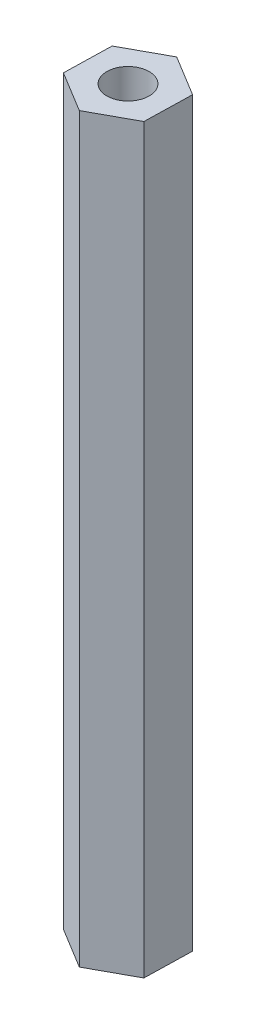
ISO-10303-21;
HEADER;
FILE_DESCRIPTION(('STEP AP214'),'2;1');
FILE_NAME('part.step','',(''),(''),'','','');
FILE_SCHEMA(('AUTOMOTIVE_DESIGN { 1 0 10303 214 1 1 1 1 }'));
ENDSEC;
DATA;
#1=APPLICATION_CONTEXT('core data for automotive mechanical design processes');
#2=APPLICATION_PROTOCOL_DEFINITION('international standard','automotive_design',2000,#1);
#3=PRODUCT_CONTEXT('',#1,'mechanical');
#4=PRODUCT('Part','Part','',(#3));
#5=PRODUCT_RELATED_PRODUCT_CATEGORY('part','',(#4));
#6=PRODUCT_DEFINITION_FORMATION('','',#4);
#7=PRODUCT_DEFINITION_CONTEXT('part definition',#1,'design');
#8=PRODUCT_DEFINITION('design','',#6,#7);
#9=PRODUCT_DEFINITION_SHAPE('','',#8);
#10=(LENGTH_UNIT() NAMED_UNIT(*) SI_UNIT(.MILLI.,.METRE.));
#11=(NAMED_UNIT(*) PLANE_ANGLE_UNIT() SI_UNIT($,.RADIAN.));
#12=(NAMED_UNIT(*) SI_UNIT($,.STERADIAN.) SOLID_ANGLE_UNIT());
#13=UNCERTAINTY_MEASURE_WITH_UNIT(LENGTH_MEASURE(1.E-05),#10,'distance_accuracy_value','');
#14=(GEOMETRIC_REPRESENTATION_CONTEXT(3) GLOBAL_UNCERTAINTY_ASSIGNED_CONTEXT((#13)) GLOBAL_UNIT_ASSIGNED_CONTEXT((#10,
#11,#12)) REPRESENTATION_CONTEXT('',''));
#15=CARTESIAN_POINT('',(0.,0.,0.));
#16=DIRECTION('',(0.,0.,1.));
#17=DIRECTION('',(1.,0.,0.));
#18=AXIS2_PLACEMENT_3D('',#15,#16,#17);
#19=CARTESIAN_POINT('',(6.26209311880989,57.15,3.81438371230362));
#20=DIRECTION('',(-0.999723848256013,0.,-0.0234995154883728));
#21=DIRECTION('',(-0.0234995154883728,0.,0.999723848256013));
#22=AXIS2_PLACEMENT_3D('',#19,#20,#21);
#23=PLANE('',#22);
#24=DIRECTION('',(0.0234995154883728,0.,-0.999723848256013));
#25=VECTOR('',#24,1.);
#26=CARTESIAN_POINT('',(6.26209311880989,-57.15,3.81438371230362));
#27=LINE('',#26,#25);
#28=CARTESIAN_POINT('',(6.26209311880989,-57.15,3.81438371230362));
#29=VERTEX_POINT('',#28);
#30=CARTESIAN_POINT('',(6.43439975404147,-57.15,-3.51593986560128));
#31=VERTEX_POINT('',#30);
#32=EDGE_CURVE('E116',#29,#31,#27,.T.);
#33=ORIENTED_EDGE('',*,*,#32,.T.);
#34=DIRECTION('',(0.,-1.,0.));
#35=VECTOR('',#34,1.);
#36=CARTESIAN_POINT('',(6.43439975404147,57.15,-3.51593986560128));
#37=LINE('',#36,#35);
#38=CARTESIAN_POINT('',(6.43439975404147,57.15,-3.51593986560128));
#39=VERTEX_POINT('',#38);
#40=EDGE_CURVE('E11',#39,#31,#37,.T.);
#41=ORIENTED_EDGE('',*,*,#40,.F.);
#42=DIRECTION('',(0.0234995154883728,0.,-0.999723848256013));
#43=VECTOR('',#42,1.);
#44=CARTESIAN_POINT('',(6.26209311880989,57.15,3.81438371230362));
#45=LINE('',#44,#43);
#46=CARTESIAN_POINT('',(6.26209311880989,57.15,3.81438371230362));
#47=VERTEX_POINT('',#46);
#48=EDGE_CURVE('E127',#47,#39,#45,.T.);
#49=ORIENTED_EDGE('',*,*,#48,.F.);
#50=DIRECTION('',(0.,-1.,0.));
#51=VECTOR('',#50,1.);
#52=CARTESIAN_POINT('',(6.26209311880989,57.15,3.81438371230362));
#53=LINE('',#52,#51);
#54=EDGE_CURVE('E112',#47,#29,#53,.T.);
#55=ORIENTED_EDGE('',*,*,#54,.T.);
#56=EDGE_LOOP('',(#33,#41,#49,#55));
#57=FACE_BOUND('',#56,.T.);
#58=ADVANCED_FACE('F32',(#57),#23,.F.);
#59=CARTESIAN_POINT('',(6.43439975404147,57.15,-3.51593986560128));
#60=DIRECTION('',(-0.520213101517563,0.,0.85403649161466));
#61=DIRECTION('',(0.85403649161466,0.,0.520213101517563));
#62=AXIS2_PLACEMENT_3D('',#59,#60,#61);
#63=PLANE('',#62);
#64=DIRECTION('',(-0.85403649161466,0.,-0.520213101517563));
#65=VECTOR('',#64,1.);
#66=CARTESIAN_POINT('',(6.43439975404147,-57.15,-3.51593986560128));
#67=LINE('',#66,#65);
#68=CARTESIAN_POINT('',(0.172306635231581,-57.15,-7.3303235779049));
#69=VERTEX_POINT('',#68);
#70=EDGE_CURVE('E119',#31,#69,#67,.T.);
#71=ORIENTED_EDGE('',*,*,#70,.T.);
#72=DIRECTION('',(0.,-1.,0.));
#73=VECTOR('',#72,1.);
#74=CARTESIAN_POINT('',(0.172306635231581,57.15,-7.3303235779049));
#75=LINE('',#74,#73);
#76=CARTESIAN_POINT('',(0.172306635231581,57.15,-7.3303235779049));
#77=VERTEX_POINT('',#76);
#78=EDGE_CURVE('E40',#77,#69,#75,.T.);
#79=ORIENTED_EDGE('',*,*,#78,.F.);
#80=DIRECTION('',(-0.85403649161466,0.,-0.520213101517563));
#81=VECTOR('',#80,1.);
#82=CARTESIAN_POINT('',(6.43439975404147,57.15,-3.51593986560128));
#83=LINE('',#82,#81);
#84=EDGE_CURVE('E85',#39,#77,#83,.T.);
#85=ORIENTED_EDGE('',*,*,#84,.F.);
#86=ORIENTED_EDGE('',*,*,#40,.T.);
#87=EDGE_LOOP('',(#71,#79,#85,#86));
#88=FACE_BOUND('',#87,.T.);
#89=ADVANCED_FACE('F152',(#88),#63,.F.);
#90=CARTESIAN_POINT('',(0.172306635231581,57.15,-7.3303235779049));
#91=DIRECTION('',(0.479510746738449,0.,0.877536007103033));
#92=DIRECTION('',(0.877536007103033,0.,-0.479510746738449));
#93=AXIS2_PLACEMENT_3D('',#90,#91,#92);
#94=PLANE('',#93);
#95=DIRECTION('',(-0.877536007103033,0.,0.479510746738449));
#96=VECTOR('',#95,1.);
#97=CARTESIAN_POINT('',(0.172306635231581,-57.15,-7.3303235779049));
#98=LINE('',#97,#96);
#99=CARTESIAN_POINT('',(-6.26209311880989,-57.15,-3.81438371230362));
#100=VERTEX_POINT('',#99);
#101=EDGE_CURVE('E122',#69,#100,#98,.T.);
#102=ORIENTED_EDGE('',*,*,#101,.T.);
#103=DIRECTION('',(0.,-1.,0.));
#104=VECTOR('',#103,1.);
#105=CARTESIAN_POINT('',(-6.26209311880989,57.15,-3.81438371230362));
#106=LINE('',#105,#104);
#107=CARTESIAN_POINT('',(-6.26209311880989,57.15,-3.81438371230362));
#108=VERTEX_POINT('',#107);
#109=EDGE_CURVE('E107',#108,#100,#106,.T.);
#110=ORIENTED_EDGE('',*,*,#109,.F.);
#111=DIRECTION('',(-0.877536007103033,0.,0.479510746738449));
#112=VECTOR('',#111,1.);
#113=CARTESIAN_POINT('',(0.172306635231581,57.15,-7.3303235779049));
#114=LINE('',#113,#112);
#115=EDGE_CURVE('E98',#77,#108,#114,.T.);
#116=ORIENTED_EDGE('',*,*,#115,.F.);
#117=ORIENTED_EDGE('',*,*,#78,.T.);
#118=EDGE_LOOP('',(#102,#110,#116,#117));
#119=FACE_BOUND('',#118,.T.);
#120=ADVANCED_FACE('F133',(#119),#94,.F.);
#121=CARTESIAN_POINT('',(-6.26209311880989,57.15,-3.81438371230362));
#122=DIRECTION('',(0.999723848256013,0.,0.0234995154883731));
#123=DIRECTION('',(0.0234995154883731,0.,-0.999723848256013));
#124=AXIS2_PLACEMENT_3D('',#121,#122,#123);
#125=PLANE('',#124);
#126=DIRECTION('',(-0.0234995154883731,0.,0.999723848256013));
#127=VECTOR('',#126,1.);
#128=CARTESIAN_POINT('',(-6.26209311880989,-57.15,-3.81438371230362));
#129=LINE('',#128,#127);
#130=CARTESIAN_POINT('',(-6.43439975404147,-57.15,3.51593986560128));
#131=VERTEX_POINT('',#130);
#132=EDGE_CURVE('E106',#100,#131,#129,.T.);
#133=ORIENTED_EDGE('',*,*,#132,.T.);
#134=DIRECTION('',(0.,-1.,0.));
#135=VECTOR('',#134,1.);
#136=CARTESIAN_POINT('',(-6.43439975404147,57.15,3.51593986560128));
#137=LINE('',#136,#135);
#138=CARTESIAN_POINT('',(-6.43439975404147,57.15,3.51593986560128));
#139=VERTEX_POINT('',#138);
#140=EDGE_CURVE('E103',#139,#131,#137,.T.);
#141=ORIENTED_EDGE('',*,*,#140,.F.);
#142=DIRECTION('',(-0.0234995154883731,0.,0.999723848256013));
#143=VECTOR('',#142,1.);
#144=CARTESIAN_POINT('',(-6.26209311880989,57.15,-3.81438371230362));
#145=LINE('',#144,#143);
#146=EDGE_CURVE('E92',#108,#139,#145,.T.);
#147=ORIENTED_EDGE('',*,*,#146,.F.);
#148=ORIENTED_EDGE('',*,*,#109,.T.);
#149=EDGE_LOOP('',(#133,#141,#147,#148));
#150=FACE_BOUND('',#149,.T.);
#151=ADVANCED_FACE('F104',(#150),#125,.F.);
#152=CARTESIAN_POINT('',(-6.43439975404147,57.15,3.51593986560128));
#153=DIRECTION('',(0.520213101517564,0.,-0.85403649161466));
#154=DIRECTION('',(-0.85403649161466,0.,-0.520213101517564));
#155=AXIS2_PLACEMENT_3D('',#152,#153,#154);
#156=PLANE('',#155);
#157=DIRECTION('',(0.85403649161466,0.,0.520213101517564));
#158=VECTOR('',#157,1.);
#159=CARTESIAN_POINT('',(-6.43439975404147,-57.15,3.51593986560128));
#160=LINE('',#159,#158);
#161=CARTESIAN_POINT('',(-0.172306635231583,-57.15,7.3303235779049));
#162=VERTEX_POINT('',#161);
#163=EDGE_CURVE('E71',#131,#162,#160,.T.);
#164=ORIENTED_EDGE('',*,*,#163,.T.);
#165=DIRECTION('',(0.,-1.,0.));
#166=VECTOR('',#165,1.);
#167=CARTESIAN_POINT('',(-0.172306635231583,57.15,7.3303235779049));
#168=LINE('',#167,#166);
#169=CARTESIAN_POINT('',(-0.172306635231583,57.15,7.3303235779049));
#170=VERTEX_POINT('',#169);
#171=EDGE_CURVE('E108',#170,#162,#168,.T.);
#172=ORIENTED_EDGE('',*,*,#171,.F.);
#173=DIRECTION('',(0.85403649161466,0.,0.520213101517564));
#174=VECTOR('',#173,1.);
#175=CARTESIAN_POINT('',(-6.43439975404147,57.15,3.51593986560128));
#176=LINE('',#175,#174);
#177=EDGE_CURVE('E96',#139,#170,#176,.T.);
#178=ORIENTED_EDGE('',*,*,#177,.F.);
#179=ORIENTED_EDGE('',*,*,#140,.T.);
#180=EDGE_LOOP('',(#164,#172,#178,#179));
#181=FACE_BOUND('',#180,.T.);
#182=ADVANCED_FACE('F110',(#181),#156,.F.);
#183=CARTESIAN_POINT('',(-0.172306635231583,57.15,7.3303235779049));
#184=DIRECTION('',(-0.47951074673845,0.,-0.877536007103033));
#185=DIRECTION('',(-0.877536007103033,0.,0.47951074673845));
#186=AXIS2_PLACEMENT_3D('',#183,#184,#185);
#187=PLANE('',#186);
#188=DIRECTION('',(0.877536007103033,0.,-0.47951074673845));
#189=VECTOR('',#188,1.);
#190=CARTESIAN_POINT('',(-0.172306635231583,-57.15,7.3303235779049));
#191=LINE('',#190,#189);
#192=EDGE_CURVE('E77',#162,#29,#191,.T.);
#193=ORIENTED_EDGE('',*,*,#192,.T.);
#194=ORIENTED_EDGE('',*,*,#54,.F.);
#195=DIRECTION('',(0.877536007103033,0.,-0.47951074673845));
#196=VECTOR('',#195,1.);
#197=CARTESIAN_POINT('',(-0.172306635231583,57.15,7.3303235779049));
#198=LINE('',#197,#196);
#199=EDGE_CURVE('E48',#170,#47,#198,.T.);
#200=ORIENTED_EDGE('',*,*,#199,.F.);
#201=ORIENTED_EDGE('',*,*,#171,.T.);
#202=EDGE_LOOP('',(#193,#194,#200,#201));
#203=FACE_BOUND('',#202,.T.);
#204=ADVANCED_FACE('F140',(#203),#187,.F.);
#205=CARTESIAN_POINT('',(0.,57.15,0.));
#206=DIRECTION('',(0.,1.,0.));
#207=DIRECTION('',(0.,0.,1.));
#208=AXIS2_PLACEMENT_3D('',#205,#206,#207);
#209=PLANE('',#208);
#210=CARTESIAN_POINT('',(0.,57.15,0.));
#211=DIRECTION('',(0.,1.,0.));
#212=DIRECTION('',(0.,0.,1.));
#213=AXIS2_PLACEMENT_3D('',#210,#211,#212);
#214=CIRCLE('',#213,3.2639);
#215=CARTESIAN_POINT('',(0.,57.15,3.2639));
#216=VERTEX_POINT('',#215);
#217=EDGE_CURVE('E235',#216,#216,#214,.T.);
#218=ORIENTED_EDGE('',*,*,#217,.F.);
#219=EDGE_LOOP('',(#218));
#220=FACE_BOUND('',#219,.T.);
#221=ORIENTED_EDGE('',*,*,#48,.T.);
#222=ORIENTED_EDGE('',*,*,#84,.T.);
#223=ORIENTED_EDGE('',*,*,#115,.T.);
#224=ORIENTED_EDGE('',*,*,#146,.T.);
#225=ORIENTED_EDGE('',*,*,#177,.T.);
#226=ORIENTED_EDGE('',*,*,#199,.T.);
#227=EDGE_LOOP('',(#221,#222,#223,#224,#225,#226));
#228=FACE_BOUND('',#227,.T.);
#229=ADVANCED_FACE('F94',(#220,#228),#209,.T.);
#230=CARTESIAN_POINT('',(0.,-57.15,0.));
#231=DIRECTION('',(0.,1.,0.));
#232=DIRECTION('',(0.,0.,1.));
#233=AXIS2_PLACEMENT_3D('',#230,#231,#232);
#234=PLANE('',#233);
#235=CARTESIAN_POINT('',(0.,-57.15,0.));
#236=DIRECTION('',(0.,1.,0.));
#237=DIRECTION('',(0.,0.,1.));
#238=AXIS2_PLACEMENT_3D('',#235,#236,#237);
#239=CIRCLE('',#238,3.2639);
#240=CARTESIAN_POINT('',(0.,-57.15,3.2639));
#241=VERTEX_POINT('',#240);
#242=EDGE_CURVE('E236',#241,#241,#239,.T.);
#243=ORIENTED_EDGE('',*,*,#242,.T.);
#244=EDGE_LOOP('',(#243));
#245=FACE_BOUND('',#244,.T.);
#246=ORIENTED_EDGE('',*,*,#32,.F.);
#247=ORIENTED_EDGE('',*,*,#192,.F.);
#248=ORIENTED_EDGE('',*,*,#163,.F.);
#249=ORIENTED_EDGE('',*,*,#132,.F.);
#250=ORIENTED_EDGE('',*,*,#101,.F.);
#251=ORIENTED_EDGE('',*,*,#70,.F.);
#252=EDGE_LOOP('',(#246,#247,#248,#249,#250,#251));
#253=FACE_BOUND('',#252,.T.);
#254=ADVANCED_FACE('F136',(#245,#253),#234,.F.);
#255=CARTESIAN_POINT('',(0.,44.45,0.));
#256=DIRECTION('',(0.,1.,0.));
#257=DIRECTION('',(0.,0.,1.));
#258=AXIS2_PLACEMENT_3D('',#255,#256,#257);
#259=CYLINDRICAL_SURFACE('',#258,3.2639);
#260=CARTESIAN_POINT('',(0.,44.45,0.));
#261=DIRECTION('',(0.,1.,0.));
#262=DIRECTION('',(0.,0.,1.));
#263=AXIS2_PLACEMENT_3D('',#260,#261,#262);
#264=CIRCLE('',#263,3.2639);
#265=CARTESIAN_POINT('',(0.,44.45,3.2639));
#266=VERTEX_POINT('',#265);
#267=EDGE_CURVE('E120',#266,#266,#264,.T.);
#268=ORIENTED_EDGE('',*,*,#267,.F.);
#269=EDGE_LOOP('',(#268));
#270=FACE_BOUND('',#269,.T.);
#271=ORIENTED_EDGE('',*,*,#217,.T.);
#272=EDGE_LOOP('',(#271));
#273=FACE_BOUND('',#272,.T.);
#274=ADVANCED_FACE('F187',(#270,#273),#259,.F.);
#275=CARTESIAN_POINT('',(0.,44.45,0.));
#276=DIRECTION('',(0.,1.,0.));
#277=DIRECTION('',(0.,0.,1.));
#278=AXIS2_PLACEMENT_3D('',#275,#276,#277);
#279=PLANE('',#278);
#280=ORIENTED_EDGE('',*,*,#267,.T.);
#281=EDGE_LOOP('',(#280));
#282=FACE_BOUND('',#281,.T.);
#283=ADVANCED_FACE('F192',(#282),#279,.T.);
#284=CARTESIAN_POINT('',(0.,-44.45,0.));
#285=DIRECTION('',(0.,-1.,0.));
#286=DIRECTION('',(0.,0.,-1.));
#287=AXIS2_PLACEMENT_3D('',#284,#285,#286);
#288=CYLINDRICAL_SURFACE('',#287,3.2639);
#289=CARTESIAN_POINT('',(0.,-44.45,0.));
#290=DIRECTION('',(0.,1.,0.));
#291=DIRECTION('',(0.,0.,1.));
#292=AXIS2_PLACEMENT_3D('',#289,#290,#291);
#293=CIRCLE('',#292,3.2639);
#294=CARTESIAN_POINT('',(0.,-44.45,3.2639));
#295=VERTEX_POINT('',#294);
#296=EDGE_CURVE('E234',#295,#295,#293,.T.);
#297=ORIENTED_EDGE('',*,*,#296,.T.);
#298=EDGE_LOOP('',(#297));
#299=FACE_BOUND('',#298,.T.);
#300=ORIENTED_EDGE('',*,*,#242,.F.);
#301=EDGE_LOOP('',(#300));
#302=FACE_BOUND('',#301,.T.);
#303=ADVANCED_FACE('F202',(#299,#302),#288,.F.);
#304=CARTESIAN_POINT('',(0.,-44.45,0.));
#305=DIRECTION('',(0.,-1.,0.));
#306=DIRECTION('',(0.,0.,1.));
#307=AXIS2_PLACEMENT_3D('',#304,#305,#306);
#308=PLANE('',#307);
#309=ORIENTED_EDGE('',*,*,#296,.F.);
#310=EDGE_LOOP('',(#309));
#311=FACE_BOUND('',#310,.T.);
#312=ADVANCED_FACE('F218',(#311),#308,.T.);
#313=CLOSED_SHELL('',(#58,#89,#120,#151,#182,#204,#229,#254,#274,#283,#303,#312));
#314=MANIFOLD_SOLID_BREP('B2',#313);
#315=ADVANCED_BREP_SHAPE_REPRESENTATION('',(#18,#314),#14);
#316=SHAPE_DEFINITION_REPRESENTATION(#9,#315);
ENDSEC;
END-ISO-10303-21;
